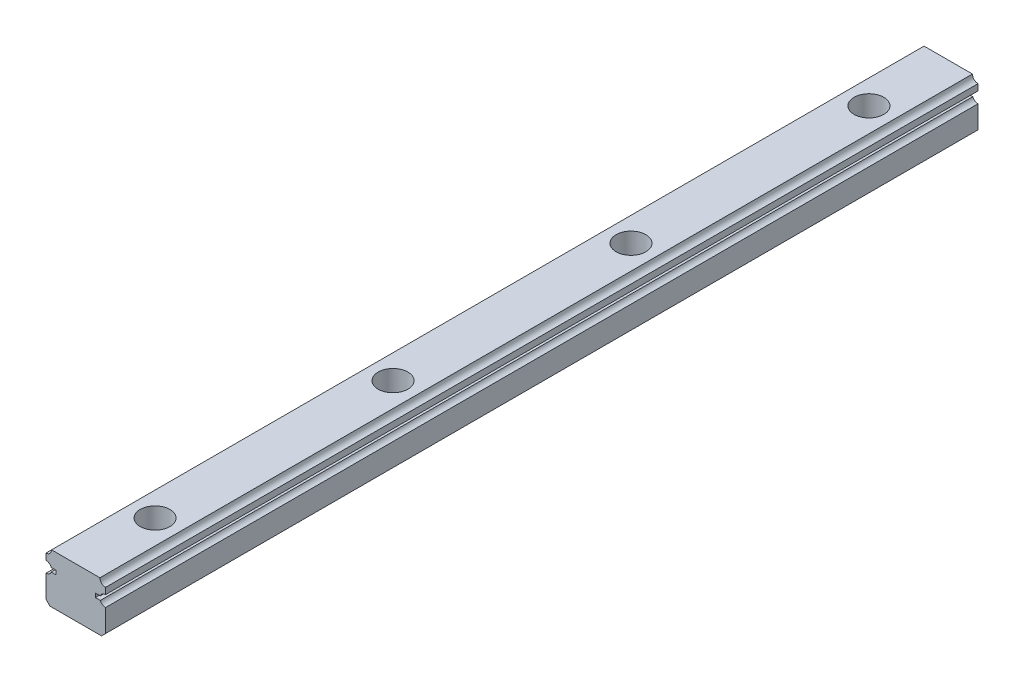
ISO-10303-21;
HEADER;
FILE_DESCRIPTION(('STEP AP214'),'2;1');
FILE_NAME('part.step','',(''),(''),'','','');
FILE_SCHEMA(('AUTOMOTIVE_DESIGN { 1 0 10303 214 1 1 1 1 }'));
ENDSEC;
DATA;
#1=APPLICATION_CONTEXT('core data for automotive mechanical design processes');
#2=APPLICATION_PROTOCOL_DEFINITION('international standard','automotive_design',2000,#1);
#3=PRODUCT_CONTEXT('',#1,'mechanical');
#4=PRODUCT('Part','Part','',(#3));
#5=PRODUCT_RELATED_PRODUCT_CATEGORY('part','',(#4));
#6=PRODUCT_DEFINITION_FORMATION('','',#4);
#7=PRODUCT_DEFINITION_CONTEXT('part definition',#1,'design');
#8=PRODUCT_DEFINITION('design','',#6,#7);
#9=PRODUCT_DEFINITION_SHAPE('','',#8);
#10=(LENGTH_UNIT() NAMED_UNIT(*) SI_UNIT(.MILLI.,.METRE.));
#11=(NAMED_UNIT(*) PLANE_ANGLE_UNIT() SI_UNIT($,.RADIAN.));
#12=(NAMED_UNIT(*) SI_UNIT($,.STERADIAN.) SOLID_ANGLE_UNIT());
#13=UNCERTAINTY_MEASURE_WITH_UNIT(LENGTH_MEASURE(1.E-05),#10,'distance_accuracy_value','');
#14=(GEOMETRIC_REPRESENTATION_CONTEXT(3) GLOBAL_UNCERTAINTY_ASSIGNED_CONTEXT((#13)) GLOBAL_UNIT_ASSIGNED_CONTEXT((#10,
#11,#12)) REPRESENTATION_CONTEXT('',''));
#15=CARTESIAN_POINT('',(0.,0.,0.));
#16=DIRECTION('',(0.,0.,1.));
#17=DIRECTION('',(1.,0.,0.));
#18=AXIS2_PLACEMENT_3D('',#15,#16,#17);
#19=CARTESIAN_POINT('',(-6.09998900000225,12.4999900000003,110.));
#20=DIRECTION('',(0.,-1.,0.));
#21=DIRECTION('',(1.,0.,0.));
#22=AXIS2_PLACEMENT_3D('',#19,#20,#21);
#23=PLANE('',#22);
#24=CARTESIAN_POINT('',(0.,12.4999900000003,-30.));
#25=DIRECTION('',(0.,1.,0.));
#26=DIRECTION('',(0.,0.,1.));
#27=AXIS2_PLACEMENT_3D('',#24,#25,#26);
#28=CIRCLE('',#27,3.75);
#29=CARTESIAN_POINT('',(0.,12.4999900000003,-26.25));
#30=VERTEX_POINT('',#29);
#31=EDGE_CURVE('E703',#30,#30,#28,.T.);
#32=ORIENTED_EDGE('',*,*,#31,.F.);
#33=EDGE_LOOP('',(#32));
#34=FACE_BOUND('',#33,.T.);
#35=DIRECTION('',(-1.,0.,0.));
#36=VECTOR('',#35,1.);
#37=CARTESIAN_POINT('',(-6.09998900000225,12.4999900000003,-110.));
#38=LINE('',#37,#36);
#39=CARTESIAN_POINT('',(6.09998900000225,12.4999900000003,-110.));
#40=VERTEX_POINT('',#39);
#41=CARTESIAN_POINT('',(-6.09998900000225,12.4999900000003,-110.));
#42=VERTEX_POINT('',#41);
#43=EDGE_CURVE('E211',#40,#42,#38,.T.);
#44=ORIENTED_EDGE('',*,*,#43,.T.);
#45=DIRECTION('',(0.,0.,-1.));
#46=VECTOR('',#45,1.);
#47=CARTESIAN_POINT('',(-6.09998900000225,12.4999900000003,110.));
#48=LINE('',#47,#46);
#49=CARTESIAN_POINT('',(-6.09998900000225,12.4999900000003,110.));
#50=VERTEX_POINT('',#49);
#51=EDGE_CURVE('E282',#50,#42,#48,.T.);
#52=ORIENTED_EDGE('',*,*,#51,.F.);
#53=DIRECTION('',(-1.,0.,0.));
#54=VECTOR('',#53,1.);
#55=CARTESIAN_POINT('',(-6.09998900000225,12.4999900000003,110.));
#56=LINE('',#55,#54);
#57=CARTESIAN_POINT('',(6.09998900000225,12.4999900000003,110.));
#58=VERTEX_POINT('',#57);
#59=EDGE_CURVE('E311',#58,#50,#56,.T.);
#60=ORIENTED_EDGE('',*,*,#59,.F.);
#61=DIRECTION('',(0.,0.,-1.));
#62=VECTOR('',#61,1.);
#63=CARTESIAN_POINT('',(6.09998900000225,12.4999900000003,110.));
#64=LINE('',#63,#62);
#65=EDGE_CURVE('E285',#58,#40,#64,.T.);
#66=ORIENTED_EDGE('',*,*,#65,.T.);
#67=EDGE_LOOP('',(#44,#52,#60,#66));
#68=FACE_BOUND('',#67,.T.);
#69=CARTESIAN_POINT('',(0.,12.4999900000003,90.));
#70=DIRECTION('',(0.,-1.,0.));
#71=DIRECTION('',(0.,0.,-1.));
#72=AXIS2_PLACEMENT_3D('',#69,#70,#71);
#73=CIRCLE('',#72,3.75);
#74=CARTESIAN_POINT('',(0.,12.4999900000003,86.25));
#75=VERTEX_POINT('',#74);
#76=EDGE_CURVE('E207',#75,#75,#73,.T.);
#77=ORIENTED_EDGE('',*,*,#76,.T.);
#78=EDGE_LOOP('',(#77));
#79=FACE_BOUND('',#78,.T.);
#80=CARTESIAN_POINT('',(0.,12.4999900000003,-90.));
#81=DIRECTION('',(0.,1.,0.));
#82=DIRECTION('',(0.,0.,1.));
#83=AXIS2_PLACEMENT_3D('',#80,#81,#82);
#84=CIRCLE('',#83,3.75);
#85=CARTESIAN_POINT('',(0.,12.4999900000003,-86.25));
#86=VERTEX_POINT('',#85);
#87=EDGE_CURVE('E722',#86,#86,#84,.T.);
#88=ORIENTED_EDGE('',*,*,#87,.F.);
#89=EDGE_LOOP('',(#88));
#90=FACE_BOUND('',#89,.T.);
#91=CARTESIAN_POINT('',(0.,12.4999900000003,30.));
#92=DIRECTION('',(0.,1.,0.));
#93=DIRECTION('',(0.,0.,1.));
#94=AXIS2_PLACEMENT_3D('',#91,#92,#93);
#95=CIRCLE('',#94,3.75);
#96=CARTESIAN_POINT('',(0.,12.4999900000003,33.75));
#97=VERTEX_POINT('',#96);
#98=EDGE_CURVE('E753',#97,#97,#95,.T.);
#99=ORIENTED_EDGE('',*,*,#98,.F.);
#100=EDGE_LOOP('',(#99));
#101=FACE_BOUND('',#100,.T.);
#102=ADVANCED_FACE('F34',(#34,#68,#79,#90,#101),#23,.F.);
#103=CARTESIAN_POINT('',(6.49996585786402,0.,110.));
#104=DIRECTION('',(0.,1.,0.));
#105=DIRECTION('',(0.,0.,1.));
#106=AXIS2_PLACEMENT_3D('',#103,#104,#105);
#107=PLANE('',#106);
#108=CARTESIAN_POINT('',(0.,0.,-30.));
#109=DIRECTION('',(0.,1.,0.));
#110=DIRECTION('',(0.,0.,1.));
#111=AXIS2_PLACEMENT_3D('',#108,#109,#110);
#112=CIRCLE('',#111,2.25);
#113=CARTESIAN_POINT('',(0.,0.,-27.75));
#114=VERTEX_POINT('',#113);
#115=EDGE_CURVE('E719',#114,#114,#112,.T.);
#116=ORIENTED_EDGE('',*,*,#115,.T.);
#117=EDGE_LOOP('',(#116));
#118=FACE_BOUND('',#117,.T.);
#119=DIRECTION('',(1.,0.,0.));
#120=VECTOR('',#119,1.);
#121=CARTESIAN_POINT('',(6.49996585786402,0.,-110.));
#122=LINE('',#121,#120);
#123=CARTESIAN_POINT('',(-6.49996585786388,0.,-110.));
#124=VERTEX_POINT('',#123);
#125=CARTESIAN_POINT('',(6.49996585786402,0.,-110.));
#126=VERTEX_POINT('',#125);
#127=EDGE_CURVE('E231',#124,#126,#122,.T.);
#128=ORIENTED_EDGE('',*,*,#127,.T.);
#129=DIRECTION('',(0.,0.,-1.));
#130=VECTOR('',#129,1.);
#131=CARTESIAN_POINT('',(6.49996585786402,0.,110.));
#132=LINE('',#131,#130);
#133=CARTESIAN_POINT('',(6.49996585786402,0.,110.));
#134=VERTEX_POINT('',#133);
#135=EDGE_CURVE('E252',#134,#126,#132,.T.);
#136=ORIENTED_EDGE('',*,*,#135,.F.);
#137=DIRECTION('',(1.,0.,0.));
#138=VECTOR('',#137,1.);
#139=CARTESIAN_POINT('',(6.49996585786402,0.,110.));
#140=LINE('',#139,#138);
#141=CARTESIAN_POINT('',(-6.49996585786388,0.,110.));
#142=VERTEX_POINT('',#141);
#143=EDGE_CURVE('E331',#142,#134,#140,.T.);
#144=ORIENTED_EDGE('',*,*,#143,.F.);
#145=DIRECTION('',(0.,0.,-1.));
#146=VECTOR('',#145,1.);
#147=CARTESIAN_POINT('',(-6.49996585786388,0.,110.));
#148=LINE('',#147,#146);
#149=EDGE_CURVE('E255',#142,#124,#148,.T.);
#150=ORIENTED_EDGE('',*,*,#149,.T.);
#151=EDGE_LOOP('',(#128,#136,#144,#150));
#152=FACE_BOUND('',#151,.T.);
#153=CARTESIAN_POINT('',(0.,0.,90.));
#154=DIRECTION('',(0.,-1.,0.));
#155=DIRECTION('',(0.,0.,-1.));
#156=AXIS2_PLACEMENT_3D('',#153,#154,#155);
#157=CIRCLE('',#156,2.25);
#158=CARTESIAN_POINT('',(0.,0.,87.75));
#159=VERTEX_POINT('',#158);
#160=EDGE_CURVE('E694',#159,#159,#157,.T.);
#161=ORIENTED_EDGE('',*,*,#160,.F.);
#162=EDGE_LOOP('',(#161));
#163=FACE_BOUND('',#162,.T.);
#164=CARTESIAN_POINT('',(0.,0.,-90.));
#165=DIRECTION('',(0.,1.,0.));
#166=DIRECTION('',(0.,0.,1.));
#167=AXIS2_PLACEMENT_3D('',#164,#165,#166);
#168=CIRCLE('',#167,2.25);
#169=CARTESIAN_POINT('',(0.,0.,-87.75));
#170=VERTEX_POINT('',#169);
#171=EDGE_CURVE('E698',#170,#170,#168,.T.);
#172=ORIENTED_EDGE('',*,*,#171,.T.);
#173=EDGE_LOOP('',(#172));
#174=FACE_BOUND('',#173,.T.);
#175=CARTESIAN_POINT('',(0.,0.,30.));
#176=DIRECTION('',(0.,1.,0.));
#177=DIRECTION('',(0.,0.,1.));
#178=AXIS2_PLACEMENT_3D('',#175,#176,#177);
#179=CIRCLE('',#178,2.25);
#180=CARTESIAN_POINT('',(0.,0.,32.25));
#181=VERTEX_POINT('',#180);
#182=EDGE_CURVE('E701',#181,#181,#179,.T.);
#183=ORIENTED_EDGE('',*,*,#182,.T.);
#184=EDGE_LOOP('',(#183));
#185=FACE_BOUND('',#184,.T.);
#186=ADVANCED_FACE('F360',(#118,#152,#163,#174,#185),#107,.F.);
#187=CARTESIAN_POINT('',(7.49999000000021,8.09999999996976,110.));
#188=DIRECTION('',(0.,0.,-1.));
#189=DIRECTION('',(-1.,0.,0.));
#190=AXIS2_PLACEMENT_3D('',#187,#188,#189);
#191=CYLINDRICAL_SURFACE('',#190,1.4);
#192=CARTESIAN_POINT('',(7.49999000000021,8.09999999996976,-110.));
#193=DIRECTION('',(0.,0.,-1.));
#194=DIRECTION('',(-1.,0.,0.));
#195=AXIS2_PLACEMENT_3D('',#192,#193,#194);
#196=CIRCLE('',#195,1.4);
#197=CARTESIAN_POINT('',(6.19232643481465,8.60001599999995,-110.));
#198=VERTEX_POINT('',#197);
#199=CARTESIAN_POINT('',(7.49998999999975,9.49999999996977,-110.));
#200=VERTEX_POINT('',#199);
#201=EDGE_CURVE('E203',#198,#200,#196,.T.);
#202=ORIENTED_EDGE('',*,*,#201,.T.);
#203=DIRECTION('',(0.,0.,-1.));
#204=VECTOR('',#203,1.);
#205=CARTESIAN_POINT('',(7.49998999999975,9.49999999996977,110.));
#206=LINE('',#205,#204);
#207=CARTESIAN_POINT('',(7.49998999999975,9.49999999996977,110.));
#208=VERTEX_POINT('',#207);
#209=EDGE_CURVE('E11',#208,#200,#206,.T.);
#210=ORIENTED_EDGE('',*,*,#209,.F.);
#211=CARTESIAN_POINT('',(7.49999000000021,8.09999999996976,110.));
#212=DIRECTION('',(0.,0.,-1.));
#213=DIRECTION('',(-1.,0.,0.));
#214=AXIS2_PLACEMENT_3D('',#211,#212,#213);
#215=CIRCLE('',#214,1.4);
#216=CARTESIAN_POINT('',(6.19232643481465,8.60001599999995,110.));
#217=VERTEX_POINT('',#216);
#218=EDGE_CURVE('E242',#217,#208,#215,.T.);
#219=ORIENTED_EDGE('',*,*,#218,.F.);
#220=DIRECTION('',(0.,0.,-1.));
#221=VECTOR('',#220,1.);
#222=CARTESIAN_POINT('',(6.19232643481465,8.60001599999995,110.));
#223=LINE('',#222,#221);
#224=EDGE_CURVE('E199',#217,#198,#223,.T.);
#225=ORIENTED_EDGE('',*,*,#224,.T.);
#226=EDGE_LOOP('',(#202,#210,#219,#225));
#227=FACE_BOUND('',#226,.T.);
#228=ADVANCED_FACE('F36',(#227),#191,.F.);
#229=CARTESIAN_POINT('',(7.49998999999975,11.0999740000294,110.));
#230=DIRECTION('',(-1.,0.,0.));
#231=DIRECTION('',(0.,-1.,0.));
#232=AXIS2_PLACEMENT_3D('',#229,#230,#231);
#233=PLANE('',#232);
#234=DIRECTION('',(0.,1.,0.));
#235=VECTOR('',#234,1.);
#236=CARTESIAN_POINT('',(7.49998999999975,11.0999740000294,-110.));
#237=LINE('',#236,#235);
#238=CARTESIAN_POINT('',(7.49998999999975,11.0999740000294,-110.));
#239=VERTEX_POINT('',#238);
#240=EDGE_CURVE('E206',#200,#239,#237,.T.);
#241=ORIENTED_EDGE('',*,*,#240,.T.);
#242=DIRECTION('',(0.,0.,-1.));
#243=VECTOR('',#242,1.);
#244=CARTESIAN_POINT('',(7.49998999999975,11.0999740000294,110.));
#245=LINE('',#244,#243);
#246=CARTESIAN_POINT('',(7.49998999999975,11.0999740000294,110.));
#247=VERTEX_POINT('',#246);
#248=EDGE_CURVE('E43',#247,#239,#245,.T.);
#249=ORIENTED_EDGE('',*,*,#248,.F.);
#250=DIRECTION('',(0.,1.,0.));
#251=VECTOR('',#250,1.);
#252=CARTESIAN_POINT('',(7.49998999999975,11.0999740000294,110.));
#253=LINE('',#252,#251);
#254=EDGE_CURVE('E130',#208,#247,#253,.T.);
#255=ORIENTED_EDGE('',*,*,#254,.F.);
#256=ORIENTED_EDGE('',*,*,#209,.T.);
#257=EDGE_LOOP('',(#241,#249,#255,#256));
#258=FACE_BOUND('',#257,.T.);
#259=ADVANCED_FACE('F373',(#258),#233,.F.);
#260=CARTESIAN_POINT('',(7.49999999999328,12.4999849999937,110.));
#261=DIRECTION('',(0.,0.,-1.));
#262=DIRECTION('',(-1.,0.,0.));
#263=AXIS2_PLACEMENT_3D('',#260,#261,#262);
#264=CYLINDRICAL_SURFACE('',#263,1.40001099999996);
#265=CARTESIAN_POINT('',(7.49999999999328,12.4999849999937,-110.));
#266=DIRECTION('',(0.,0.,-1.));
#267=DIRECTION('',(-1.,0.,0.));
#268=AXIS2_PLACEMENT_3D('',#265,#266,#267);
#269=CIRCLE('',#268,1.40001099999996);
#270=EDGE_CURVE('E209',#239,#40,#269,.T.);
#271=ORIENTED_EDGE('',*,*,#270,.T.);
#272=ORIENTED_EDGE('',*,*,#65,.F.);
#273=CARTESIAN_POINT('',(7.49999999999328,12.4999849999937,110.));
#274=DIRECTION('',(0.,0.,-1.));
#275=DIRECTION('',(-1.,0.,0.));
#276=AXIS2_PLACEMENT_3D('',#273,#274,#275);
#277=CIRCLE('',#276,1.40001099999996);
#278=EDGE_CURVE('E293',#247,#58,#277,.T.);
#279=ORIENTED_EDGE('',*,*,#278,.F.);
#280=ORIENTED_EDGE('',*,*,#248,.T.);
#281=EDGE_LOOP('',(#271,#272,#279,#280));
#282=FACE_BOUND('',#281,.T.);
#283=ADVANCED_FACE('F291',(#282),#264,.F.);
#284=CARTESIAN_POINT('',(-7.49999999999333,12.4999849999938,110.));
#285=DIRECTION('',(0.,0.,-1.));
#286=DIRECTION('',(-1.,0.,0.));
#287=AXIS2_PLACEMENT_3D('',#284,#285,#286);
#288=CYLINDRICAL_SURFACE('',#287,1.40001100000001);
#289=CARTESIAN_POINT('',(-7.49999999999333,12.4999849999938,-110.));
#290=DIRECTION('',(0.,0.,-1.));
#291=DIRECTION('',(-1.,0.,0.));
#292=AXIS2_PLACEMENT_3D('',#289,#290,#291);
#293=CIRCLE('',#292,1.40001100000001);
#294=CARTESIAN_POINT('',(-7.49998999999979,11.0999740000295,-110.));
#295=VERTEX_POINT('',#294);
#296=EDGE_CURVE('E213',#42,#295,#293,.T.);
#297=ORIENTED_EDGE('',*,*,#296,.T.);
#298=DIRECTION('',(0.,0.,-1.));
#299=VECTOR('',#298,1.);
#300=CARTESIAN_POINT('',(-7.49998999999979,11.0999740000295,110.));
#301=LINE('',#300,#299);
#302=CARTESIAN_POINT('',(-7.49998999999979,11.0999740000295,110.));
#303=VERTEX_POINT('',#302);
#304=EDGE_CURVE('E279',#303,#295,#301,.T.);
#305=ORIENTED_EDGE('',*,*,#304,.F.);
#306=CARTESIAN_POINT('',(-7.49999999999333,12.4999849999938,110.));
#307=DIRECTION('',(0.,0.,-1.));
#308=DIRECTION('',(-1.,0.,0.));
#309=AXIS2_PLACEMENT_3D('',#306,#307,#308);
#310=CIRCLE('',#309,1.40001100000001);
#311=EDGE_CURVE('E308',#50,#303,#310,.T.);
#312=ORIENTED_EDGE('',*,*,#311,.F.);
#313=ORIENTED_EDGE('',*,*,#51,.T.);
#314=EDGE_LOOP('',(#297,#305,#312,#313));
#315=FACE_BOUND('',#314,.T.);
#316=ADVANCED_FACE('F306',(#315),#288,.F.);
#317=CARTESIAN_POINT('',(-7.49998999999981,9.49999999994918,110.));
#318=DIRECTION('',(1.,0.,0.));
#319=DIRECTION('',(0.,1.,0.));
#320=AXIS2_PLACEMENT_3D('',#317,#318,#319);
#321=PLANE('',#320);
#322=DIRECTION('',(0.,-1.,0.));
#323=VECTOR('',#322,1.);
#324=CARTESIAN_POINT('',(-7.49998999999981,9.49999999994918,-110.));
#325=LINE('',#324,#323);
#326=CARTESIAN_POINT('',(-7.49998999999981,9.49999999994918,-110.));
#327=VERTEX_POINT('',#326);
#328=EDGE_CURVE('E215',#295,#327,#325,.T.);
#329=ORIENTED_EDGE('',*,*,#328,.T.);
#330=DIRECTION('',(0.,0.,-1.));
#331=VECTOR('',#330,1.);
#332=CARTESIAN_POINT('',(-7.49998999999981,9.49999999994918,110.));
#333=LINE('',#332,#331);
#334=CARTESIAN_POINT('',(-7.49998999999981,9.49999999994918,110.));
#335=VERTEX_POINT('',#334);
#336=EDGE_CURVE('E276',#335,#327,#333,.T.);
#337=ORIENTED_EDGE('',*,*,#336,.F.);
#338=DIRECTION('',(0.,-1.,0.));
#339=VECTOR('',#338,1.);
#340=CARTESIAN_POINT('',(-7.49998999999981,9.49999999994918,110.));
#341=LINE('',#340,#339);
#342=EDGE_CURVE('E310',#303,#335,#341,.T.);
#343=ORIENTED_EDGE('',*,*,#342,.F.);
#344=ORIENTED_EDGE('',*,*,#304,.T.);
#345=EDGE_LOOP('',(#329,#337,#343,#344));
#346=FACE_BOUND('',#345,.T.);
#347=ADVANCED_FACE('F631',(#346),#321,.F.);
#348=CARTESIAN_POINT('',(-7.49998999999982,8.09999999994918,110.));
#349=DIRECTION('',(0.,0.,-1.));
#350=DIRECTION('',(-1.,0.,0.));
#351=AXIS2_PLACEMENT_3D('',#348,#349,#350);
#352=CYLINDRICAL_SURFACE('',#351,1.4);
#353=CARTESIAN_POINT('',(-7.49998999999982,8.09999999994918,-110.));
#354=DIRECTION('',(0.,0.,-1.));
#355=DIRECTION('',(-1.,0.,0.));
#356=AXIS2_PLACEMENT_3D('',#353,#354,#355);
#357=CIRCLE('',#356,1.4);
#358=CARTESIAN_POINT('',(-6.19232643481046,8.60001599996944,-110.));
#359=VERTEX_POINT('',#358);
#360=EDGE_CURVE('E217',#327,#359,#357,.T.);
#361=ORIENTED_EDGE('',*,*,#360,.T.);
#362=DIRECTION('',(0.,0.,-1.));
#363=VECTOR('',#362,1.);
#364=CARTESIAN_POINT('',(-6.19232643481046,8.60001599996944,110.));
#365=LINE('',#364,#363);
#366=CARTESIAN_POINT('',(-6.19232643481046,8.60001599996944,110.));
#367=VERTEX_POINT('',#366);
#368=EDGE_CURVE('E273',#367,#359,#365,.T.);
#369=ORIENTED_EDGE('',*,*,#368,.F.);
#370=CARTESIAN_POINT('',(-7.49998999999982,8.09999999994918,110.));
#371=DIRECTION('',(0.,0.,-1.));
#372=DIRECTION('',(-1.,0.,0.));
#373=AXIS2_PLACEMENT_3D('',#370,#371,#372);
#374=CIRCLE('',#373,1.4);
#375=EDGE_CURVE('E313',#335,#367,#374,.T.);
#376=ORIENTED_EDGE('',*,*,#375,.F.);
#377=ORIENTED_EDGE('',*,*,#336,.T.);
#378=EDGE_LOOP('',(#361,#369,#376,#377));
#379=FACE_BOUND('',#378,.T.);
#380=ADVANCED_FACE('F621',(#379),#352,.F.);
#381=CARTESIAN_POINT('',(-4.94997199999982,8.60000600000019,110.));
#382=DIRECTION('',(8.04920799129945E-06,0.999999999967605,0.));
#383=DIRECTION('',(-0.999999999967605,8.04920799129945E-06,0.));
#384=AXIS2_PLACEMENT_3D('',#381,#382,#383);
#385=PLANE('',#384);
#386=DIRECTION('',(0.999999999967605,-8.04920799129945E-06,0.));
#387=VECTOR('',#386,1.);
#388=CARTESIAN_POINT('',(-4.94997199999982,8.60000600000019,-110.));
#389=LINE('',#388,#387);
#390=CARTESIAN_POINT('',(-4.94997199999982,8.60000600000019,-110.));
#391=VERTEX_POINT('',#390);
#392=EDGE_CURVE('E219',#359,#391,#389,.T.);
#393=ORIENTED_EDGE('',*,*,#392,.T.);
#394=DIRECTION('',(0.,0.,-1.));
#395=VECTOR('',#394,1.);
#396=CARTESIAN_POINT('',(-4.94997199999982,8.60000600000019,110.));
#397=LINE('',#396,#395);
#398=CARTESIAN_POINT('',(-4.94997199999982,8.60000600000019,110.));
#399=VERTEX_POINT('',#398);
#400=EDGE_CURVE('E270',#399,#391,#397,.T.);
#401=ORIENTED_EDGE('',*,*,#400,.F.);
#402=DIRECTION('',(0.999999999967605,-8.04920799129945E-06,0.));
#403=VECTOR('',#402,1.);
#404=CARTESIAN_POINT('',(-4.94997199999982,8.60000600000019,110.));
#405=LINE('',#404,#403);
#406=EDGE_CURVE('E319',#367,#399,#405,.T.);
#407=ORIENTED_EDGE('',*,*,#406,.F.);
#408=ORIENTED_EDGE('',*,*,#368,.T.);
#409=EDGE_LOOP('',(#393,#401,#407,#408));
#410=FACE_BOUND('',#409,.T.);
#411=ADVANCED_FACE('F611',(#410),#385,.F.);
#412=CARTESIAN_POINT('',(-4.9499819999998,7.59999600000017,110.));
#413=DIRECTION('',(0.999999999950001,-9.99989999003211E-06,0.));
#414=DIRECTION('',(9.99989999003211E-06,0.999999999950001,0.));
#415=AXIS2_PLACEMENT_3D('',#412,#413,#414);
#416=PLANE('',#415);
#417=DIRECTION('',(-9.99989999003211E-06,-0.999999999950001,0.));
#418=VECTOR('',#417,1.);
#419=CARTESIAN_POINT('',(-4.9499819999998,7.59999600000017,-110.));
#420=LINE('',#419,#418);
#421=CARTESIAN_POINT('',(-4.9499819999998,7.59999600000017,-110.));
#422=VERTEX_POINT('',#421);
#423=EDGE_CURVE('E221',#391,#422,#420,.T.);
#424=ORIENTED_EDGE('',*,*,#423,.T.);
#425=DIRECTION('',(0.,0.,-1.));
#426=VECTOR('',#425,1.);
#427=CARTESIAN_POINT('',(-4.9499819999998,7.59999600000017,110.));
#428=LINE('',#427,#426);
#429=CARTESIAN_POINT('',(-4.9499819999998,7.59999600000017,110.));
#430=VERTEX_POINT('',#429);
#431=EDGE_CURVE('E267',#430,#422,#428,.T.);
#432=ORIENTED_EDGE('',*,*,#431,.F.);
#433=DIRECTION('',(-9.99989999003211E-06,-0.999999999950001,0.));
#434=VECTOR('',#433,1.);
#435=CARTESIAN_POINT('',(-4.9499819999998,7.59999600000017,110.));
#436=LINE('',#435,#434);
#437=EDGE_CURVE('E321',#399,#430,#436,.T.);
#438=ORIENTED_EDGE('',*,*,#437,.F.);
#439=ORIENTED_EDGE('',*,*,#400,.T.);
#440=EDGE_LOOP('',(#424,#432,#438,#439));
#441=FACE_BOUND('',#440,.T.);
#442=ADVANCED_FACE('F601',(#441),#416,.F.);
#443=CARTESIAN_POINT('',(-6.19232184636335,7.59999600000018,110.));
#444=DIRECTION('',(0.,-1.,0.));
#445=DIRECTION('',(1.,0.,0.));
#446=AXIS2_PLACEMENT_3D('',#443,#444,#445);
#447=PLANE('',#446);
#448=DIRECTION('',(-1.,0.,0.));
#449=VECTOR('',#448,1.);
#450=CARTESIAN_POINT('',(-6.19232184636335,7.59999600000018,-110.));
#451=LINE('',#450,#449);
#452=CARTESIAN_POINT('',(-6.19232184636335,7.59999600000018,-110.));
#453=VERTEX_POINT('',#452);
#454=EDGE_CURVE('E223',#422,#453,#451,.T.);
#455=ORIENTED_EDGE('',*,*,#454,.T.);
#456=DIRECTION('',(0.,0.,-1.));
#457=VECTOR('',#456,1.);
#458=CARTESIAN_POINT('',(-6.19232184636335,7.59999600000018,110.));
#459=LINE('',#458,#457);
#460=CARTESIAN_POINT('',(-6.19232184636335,7.59999600000018,110.));
#461=VERTEX_POINT('',#460);
#462=EDGE_CURVE('E264',#461,#453,#459,.T.);
#463=ORIENTED_EDGE('',*,*,#462,.F.);
#464=DIRECTION('',(-1.,0.,0.));
#465=VECTOR('',#464,1.);
#466=CARTESIAN_POINT('',(-6.19232184636335,7.59999600000018,110.));
#467=LINE('',#466,#465);
#468=EDGE_CURVE('E323',#430,#461,#467,.T.);
#469=ORIENTED_EDGE('',*,*,#468,.F.);
#470=ORIENTED_EDGE('',*,*,#431,.T.);
#471=EDGE_LOOP('',(#455,#463,#469,#470));
#472=FACE_BOUND('',#471,.T.);
#473=ADVANCED_FACE('F591',(#472),#447,.F.);
#474=CARTESIAN_POINT('',(-7.49998999999982,8.09999999994918,110.));
#475=DIRECTION('',(0.,0.,-1.));
#476=DIRECTION('',(-1.,0.,0.));
#477=AXIS2_PLACEMENT_3D('',#474,#475,#476);
#478=CYLINDRICAL_SURFACE('',#477,1.40000000000001);
#479=CARTESIAN_POINT('',(-7.49998999999982,8.09999999994918,-110.));
#480=DIRECTION('',(0.,0.,-1.));
#481=DIRECTION('',(-1.,0.,0.));
#482=AXIS2_PLACEMENT_3D('',#479,#480,#481);
#483=CIRCLE('',#482,1.40000000000001);
#484=CARTESIAN_POINT('',(-7.49998999999966,6.69999999994918,-110.));
#485=VERTEX_POINT('',#484);
#486=EDGE_CURVE('E225',#453,#485,#483,.T.);
#487=ORIENTED_EDGE('',*,*,#486,.T.);
#488=DIRECTION('',(0.,0.,-1.));
#489=VECTOR('',#488,1.);
#490=CARTESIAN_POINT('',(-7.49998999999966,6.69999999994918,110.));
#491=LINE('',#490,#489);
#492=CARTESIAN_POINT('',(-7.49998999999966,6.69999999994918,110.));
#493=VERTEX_POINT('',#492);
#494=EDGE_CURVE('E261',#493,#485,#491,.T.);
#495=ORIENTED_EDGE('',*,*,#494,.F.);
#496=CARTESIAN_POINT('',(-7.49998999999982,8.09999999994918,110.));
#497=DIRECTION('',(0.,0.,-1.));
#498=DIRECTION('',(-1.,0.,0.));
#499=AXIS2_PLACEMENT_3D('',#496,#497,#498);
#500=CIRCLE('',#499,1.40000000000001);
#501=EDGE_CURVE('E325',#461,#493,#500,.T.);
#502=ORIENTED_EDGE('',*,*,#501,.F.);
#503=ORIENTED_EDGE('',*,*,#462,.T.);
#504=EDGE_LOOP('',(#487,#495,#502,#503));
#505=FACE_BOUND('',#504,.T.);
#506=ADVANCED_FACE('F581',(#505),#478,.F.);
#507=CARTESIAN_POINT('',(-7.49998999999966,1.00002414213572,110.));
#508=DIRECTION('',(1.,0.,0.));
#509=DIRECTION('',(0.,1.,0.));
#510=AXIS2_PLACEMENT_3D('',#507,#508,#509);
#511=PLANE('',#510);
#512=DIRECTION('',(0.,-1.,0.));
#513=VECTOR('',#512,1.);
#514=CARTESIAN_POINT('',(-7.49998999999966,1.00002414213572,-110.));
#515=LINE('',#514,#513);
#516=CARTESIAN_POINT('',(-7.49998999999966,1.00002414213572,-110.));
#517=VERTEX_POINT('',#516);
#518=EDGE_CURVE('E227',#485,#517,#515,.T.);
#519=ORIENTED_EDGE('',*,*,#518,.T.);
#520=DIRECTION('',(0.,0.,-1.));
#521=VECTOR('',#520,1.);
#522=CARTESIAN_POINT('',(-7.49998999999966,1.00002414213572,110.));
#523=LINE('',#522,#521);
#524=CARTESIAN_POINT('',(-7.49998999999966,1.00002414213572,110.));
#525=VERTEX_POINT('',#524);
#526=EDGE_CURVE('E258',#525,#517,#523,.T.);
#527=ORIENTED_EDGE('',*,*,#526,.F.);
#528=DIRECTION('',(0.,-1.,0.));
#529=VECTOR('',#528,1.);
#530=CARTESIAN_POINT('',(-7.49998999999966,1.00002414213572,110.));
#531=LINE('',#530,#529);
#532=EDGE_CURVE('E327',#493,#525,#531,.T.);
#533=ORIENTED_EDGE('',*,*,#532,.F.);
#534=ORIENTED_EDGE('',*,*,#494,.T.);
#535=EDGE_LOOP('',(#519,#527,#533,#534));
#536=FACE_BOUND('',#535,.T.);
#537=ADVANCED_FACE('F571',(#536),#511,.F.);
#538=CARTESIAN_POINT('',(-6.49996585786388,0.,110.));
#539=DIRECTION('',(0.707106781186548,0.707106781186548,0.));
#540=DIRECTION('',(-0.707106781186548,0.707106781186548,0.));
#541=AXIS2_PLACEMENT_3D('',#538,#539,#540);
#542=PLANE('',#541);
#543=DIRECTION('',(0.707106781186548,-0.707106781186548,0.));
#544=VECTOR('',#543,1.);
#545=CARTESIAN_POINT('',(-6.49996585786388,0.,-110.));
#546=LINE('',#545,#544);
#547=EDGE_CURVE('E229',#517,#124,#546,.T.);
#548=ORIENTED_EDGE('',*,*,#547,.T.);
#549=ORIENTED_EDGE('',*,*,#149,.F.);
#550=DIRECTION('',(0.707106781186548,-0.707106781186548,0.));
#551=VECTOR('',#550,1.);
#552=CARTESIAN_POINT('',(-6.49996585786388,0.,110.));
#553=LINE('',#552,#551);
#554=EDGE_CURVE('E329',#525,#142,#553,.T.);
#555=ORIENTED_EDGE('',*,*,#554,.F.);
#556=ORIENTED_EDGE('',*,*,#526,.T.);
#557=EDGE_LOOP('',(#548,#549,#555,#556));
#558=FACE_BOUND('',#557,.T.);
#559=ADVANCED_FACE('F561',(#558),#542,.F.);
#560=CARTESIAN_POINT('',(7.49999,1.00002414213591,110.));
#561=DIRECTION('',(-0.707106781186548,0.707106781186547,0.));
#562=DIRECTION('',(-0.707106781186547,-0.707106781186548,0.));
#563=AXIS2_PLACEMENT_3D('',#560,#561,#562);
#564=PLANE('',#563);
#565=DIRECTION('',(0.707106781186547,0.707106781186548,0.));
#566=VECTOR('',#565,1.);
#567=CARTESIAN_POINT('',(7.49999,1.00002414213591,-110.));
#568=LINE('',#567,#566);
#569=CARTESIAN_POINT('',(7.49999,1.00002414213591,-110.));
#570=VERTEX_POINT('',#569);
#571=EDGE_CURVE('E233',#126,#570,#568,.T.);
#572=ORIENTED_EDGE('',*,*,#571,.T.);
#573=DIRECTION('',(0.,0.,-1.));
#574=VECTOR('',#573,1.);
#575=CARTESIAN_POINT('',(7.49999,1.00002414213591,110.));
#576=LINE('',#575,#574);
#577=CARTESIAN_POINT('',(7.49999,1.00002414213591,110.));
#578=VERTEX_POINT('',#577);
#579=EDGE_CURVE('E249',#578,#570,#576,.T.);
#580=ORIENTED_EDGE('',*,*,#579,.F.);
#581=DIRECTION('',(0.707106781186547,0.707106781186548,0.));
#582=VECTOR('',#581,1.);
#583=CARTESIAN_POINT('',(7.49999,1.00002414213591,110.));
#584=LINE('',#583,#582);
#585=EDGE_CURVE('E333',#134,#578,#584,.T.);
#586=ORIENTED_EDGE('',*,*,#585,.F.);
#587=ORIENTED_EDGE('',*,*,#135,.T.);
#588=EDGE_LOOP('',(#572,#580,#586,#587));
#589=FACE_BOUND('',#588,.T.);
#590=ADVANCED_FACE('F552',(#589),#564,.F.);
#591=CARTESIAN_POINT('',(7.49999,6.69999999996978,110.));
#592=DIRECTION('',(-1.,0.,0.));
#593=DIRECTION('',(0.,0.,1.));
#594=AXIS2_PLACEMENT_3D('',#591,#592,#593);
#595=PLANE('',#594);
#596=DIRECTION('',(0.,1.,0.));
#597=VECTOR('',#596,1.);
#598=CARTESIAN_POINT('',(7.49999,6.69999999996978,-110.));
#599=LINE('',#598,#597);
#600=CARTESIAN_POINT('',(7.49999,6.69999999996978,-110.));
#601=VERTEX_POINT('',#600);
#602=EDGE_CURVE('E235',#570,#601,#599,.T.);
#603=ORIENTED_EDGE('',*,*,#602,.T.);
#604=DIRECTION('',(0.,0.,-1.));
#605=VECTOR('',#604,1.);
#606=CARTESIAN_POINT('',(7.49999,6.69999999996978,110.));
#607=LINE('',#606,#605);
#608=CARTESIAN_POINT('',(7.49999,6.69999999996978,110.));
#609=VERTEX_POINT('',#608);
#610=EDGE_CURVE('E246',#609,#601,#607,.T.);
#611=ORIENTED_EDGE('',*,*,#610,.F.);
#612=DIRECTION('',(0.,1.,0.));
#613=VECTOR('',#612,1.);
#614=CARTESIAN_POINT('',(7.49999,6.69999999996978,110.));
#615=LINE('',#614,#613);
#616=EDGE_CURVE('E335',#578,#609,#615,.T.);
#617=ORIENTED_EDGE('',*,*,#616,.F.);
#618=ORIENTED_EDGE('',*,*,#579,.T.);
#619=EDGE_LOOP('',(#603,#611,#617,#618));
#620=FACE_BOUND('',#619,.T.);
#621=ADVANCED_FACE('F341',(#620),#595,.F.);
#622=CARTESIAN_POINT('',(7.49999000000021,8.09999999996976,110.));
#623=DIRECTION('',(0.,0.,-1.));
#624=DIRECTION('',(-1.,0.,0.));
#625=AXIS2_PLACEMENT_3D('',#622,#623,#624);
#626=CYLINDRICAL_SURFACE('',#625,1.39999999999998);
#627=CARTESIAN_POINT('',(7.49999000000021,8.09999999996976,-110.));
#628=DIRECTION('',(0.,0.,-1.));
#629=DIRECTION('',(-1.,0.,0.));
#630=AXIS2_PLACEMENT_3D('',#627,#628,#629);
#631=CIRCLE('',#630,1.39999999999998);
#632=CARTESIAN_POINT('',(6.19232184638777,7.599995999958,-110.));
#633=VERTEX_POINT('',#632);
#634=EDGE_CURVE('E237',#601,#633,#631,.T.);
#635=ORIENTED_EDGE('',*,*,#634,.T.);
#636=DIRECTION('',(0.,0.,-1.));
#637=VECTOR('',#636,1.);
#638=CARTESIAN_POINT('',(6.19232184638777,7.599995999958,110.));
#639=LINE('',#638,#637);
#640=CARTESIAN_POINT('',(6.19232184638777,7.599995999958,110.));
#641=VERTEX_POINT('',#640);
#642=EDGE_CURVE('E194',#641,#633,#639,.T.);
#643=ORIENTED_EDGE('',*,*,#642,.F.);
#644=CARTESIAN_POINT('',(7.49999000000021,8.09999999996976,110.));
#645=DIRECTION('',(0.,0.,-1.));
#646=DIRECTION('',(-1.,0.,0.));
#647=AXIS2_PLACEMENT_3D('',#644,#645,#646);
#648=CIRCLE('',#647,1.39999999999998);
#649=EDGE_CURVE('E185',#609,#641,#648,.T.);
#650=ORIENTED_EDGE('',*,*,#649,.F.);
#651=ORIENTED_EDGE('',*,*,#610,.T.);
#652=EDGE_LOOP('',(#635,#643,#650,#651));
#653=FACE_BOUND('',#652,.T.);
#654=ADVANCED_FACE('F345',(#653),#626,.F.);
#655=CARTESIAN_POINT('',(4.94997200000024,7.60000599999994,110.));
#656=DIRECTION('',(-8.04929623135913E-06,-0.999999999967605,0.));
#657=DIRECTION('',(0.999999999967605,-8.04929623135913E-06,0.));
#658=AXIS2_PLACEMENT_3D('',#655,#656,#657);
#659=PLANE('',#658);
#660=DIRECTION('',(-0.999999999967604,8.04929623135913E-06,0.));
#661=VECTOR('',#660,1.);
#662=CARTESIAN_POINT('',(4.94997200000024,7.60000599999994,-110.));
#663=LINE('',#662,#661);
#664=CARTESIAN_POINT('',(4.94997200000024,7.60000599999994,-110.));
#665=VERTEX_POINT('',#664);
#666=EDGE_CURVE('E193',#633,#665,#663,.T.);
#667=ORIENTED_EDGE('',*,*,#666,.T.);
#668=DIRECTION('',(0.,0.,-1.));
#669=VECTOR('',#668,1.);
#670=CARTESIAN_POINT('',(4.94997200000024,7.60000599999994,110.));
#671=LINE('',#670,#669);
#672=CARTESIAN_POINT('',(4.94997200000024,7.60000599999994,110.));
#673=VERTEX_POINT('',#672);
#674=EDGE_CURVE('E190',#673,#665,#671,.T.);
#675=ORIENTED_EDGE('',*,*,#674,.F.);
#676=DIRECTION('',(-0.999999999967604,8.04929623135913E-06,0.));
#677=VECTOR('',#676,1.);
#678=CARTESIAN_POINT('',(4.94997200000024,7.60000599999994,110.));
#679=LINE('',#678,#677);
#680=EDGE_CURVE('E179',#641,#673,#679,.T.);
#681=ORIENTED_EDGE('',*,*,#680,.F.);
#682=ORIENTED_EDGE('',*,*,#642,.T.);
#683=EDGE_LOOP('',(#667,#675,#681,#682));
#684=FACE_BOUND('',#683,.T.);
#685=ADVANCED_FACE('F191',(#684),#659,.F.);
#686=CARTESIAN_POINT('',(4.94998200000026,8.60001599999997,110.));
#687=DIRECTION('',(-0.999999999950001,9.9999000160527E-06,0.));
#688=DIRECTION('',(-9.9999000160527E-06,-0.999999999950001,0.));
#689=AXIS2_PLACEMENT_3D('',#686,#687,#688);
#690=PLANE('',#689);
#691=DIRECTION('',(9.9999000160527E-06,0.999999999950001,0.));
#692=VECTOR('',#691,1.);
#693=CARTESIAN_POINT('',(4.94998200000026,8.60001599999997,-110.));
#694=LINE('',#693,#692);
#695=CARTESIAN_POINT('',(4.94998200000026,8.60001599999997,-110.));
#696=VERTEX_POINT('',#695);
#697=EDGE_CURVE('E116',#665,#696,#694,.T.);
#698=ORIENTED_EDGE('',*,*,#697,.T.);
#699=DIRECTION('',(0.,0.,-1.));
#700=VECTOR('',#699,1.);
#701=CARTESIAN_POINT('',(4.94998200000026,8.60001599999997,110.));
#702=LINE('',#701,#700);
#703=CARTESIAN_POINT('',(4.94998200000026,8.60001599999997,110.));
#704=VERTEX_POINT('',#703);
#705=EDGE_CURVE('E195',#704,#696,#702,.T.);
#706=ORIENTED_EDGE('',*,*,#705,.F.);
#707=DIRECTION('',(9.9999000160527E-06,0.999999999950001,0.));
#708=VECTOR('',#707,1.);
#709=CARTESIAN_POINT('',(4.94998200000026,8.60001599999997,110.));
#710=LINE('',#709,#708);
#711=EDGE_CURVE('E183',#673,#704,#710,.T.);
#712=ORIENTED_EDGE('',*,*,#711,.F.);
#713=ORIENTED_EDGE('',*,*,#674,.T.);
#714=EDGE_LOOP('',(#698,#706,#712,#713));
#715=FACE_BOUND('',#714,.T.);
#716=ADVANCED_FACE('F197',(#715),#690,.F.);
#717=CARTESIAN_POINT('',(6.19232643481465,8.60001599999995,110.));
#718=DIRECTION('',(0.,1.,0.));
#719=DIRECTION('',(-1.,0.,0.));
#720=AXIS2_PLACEMENT_3D('',#717,#718,#719);
#721=PLANE('',#720);
#722=DIRECTION('',(1.,0.,0.));
#723=VECTOR('',#722,1.);
#724=CARTESIAN_POINT('',(6.19232643481465,8.60001599999995,-110.));
#725=LINE('',#724,#723);
#726=EDGE_CURVE('E122',#696,#198,#725,.T.);
#727=ORIENTED_EDGE('',*,*,#726,.T.);
#728=ORIENTED_EDGE('',*,*,#224,.F.);
#729=DIRECTION('',(1.,0.,0.));
#730=VECTOR('',#729,1.);
#731=CARTESIAN_POINT('',(6.19232643481465,8.60001599999995,110.));
#732=LINE('',#731,#730);
#733=EDGE_CURVE('E51',#704,#217,#732,.T.);
#734=ORIENTED_EDGE('',*,*,#733,.F.);
#735=ORIENTED_EDGE('',*,*,#705,.T.);
#736=EDGE_LOOP('',(#727,#728,#734,#735));
#737=FACE_BOUND('',#736,.T.);
#738=ADVANCED_FACE('F349',(#737),#721,.F.);
#739=CARTESIAN_POINT('',(7.49999000000021,8.09999999996976,110.));
#740=DIRECTION('',(0.,0.,-1.));
#741=DIRECTION('',(-1.,0.,0.));
#742=AXIS2_PLACEMENT_3D('',#739,#740,#741);
#743=PLANE('',#742);
#744=ORIENTED_EDGE('',*,*,#218,.T.);
#745=ORIENTED_EDGE('',*,*,#254,.T.);
#746=ORIENTED_EDGE('',*,*,#278,.T.);
#747=ORIENTED_EDGE('',*,*,#59,.T.);
#748=ORIENTED_EDGE('',*,*,#311,.T.);
#749=ORIENTED_EDGE('',*,*,#342,.T.);
#750=ORIENTED_EDGE('',*,*,#375,.T.);
#751=ORIENTED_EDGE('',*,*,#406,.T.);
#752=ORIENTED_EDGE('',*,*,#437,.T.);
#753=ORIENTED_EDGE('',*,*,#468,.T.);
#754=ORIENTED_EDGE('',*,*,#501,.T.);
#755=ORIENTED_EDGE('',*,*,#532,.T.);
#756=ORIENTED_EDGE('',*,*,#554,.T.);
#757=ORIENTED_EDGE('',*,*,#143,.T.);
#758=ORIENTED_EDGE('',*,*,#585,.T.);
#759=ORIENTED_EDGE('',*,*,#616,.T.);
#760=ORIENTED_EDGE('',*,*,#649,.T.);
#761=ORIENTED_EDGE('',*,*,#680,.T.);
#762=ORIENTED_EDGE('',*,*,#711,.T.);
#763=ORIENTED_EDGE('',*,*,#733,.T.);
#764=EDGE_LOOP('',(#744,#745,#746,#747,#748,#749,#750,#751,#752,#753,#754,#755,#756,#757,#758,
#759,#760,#761,#762,#763));
#765=FACE_BOUND('',#764,.T.);
#766=ADVANCED_FACE('F181',(#765),#743,.F.);
#767=CARTESIAN_POINT('',(7.49999000000021,8.09999999996976,-110.));
#768=DIRECTION('',(0.,0.,-1.));
#769=DIRECTION('',(-1.,0.,0.));
#770=AXIS2_PLACEMENT_3D('',#767,#768,#769);
#771=PLANE('',#770);
#772=ORIENTED_EDGE('',*,*,#201,.F.);
#773=ORIENTED_EDGE('',*,*,#726,.F.);
#774=ORIENTED_EDGE('',*,*,#697,.F.);
#775=ORIENTED_EDGE('',*,*,#666,.F.);
#776=ORIENTED_EDGE('',*,*,#634,.F.);
#777=ORIENTED_EDGE('',*,*,#602,.F.);
#778=ORIENTED_EDGE('',*,*,#571,.F.);
#779=ORIENTED_EDGE('',*,*,#127,.F.);
#780=ORIENTED_EDGE('',*,*,#547,.F.);
#781=ORIENTED_EDGE('',*,*,#518,.F.);
#782=ORIENTED_EDGE('',*,*,#486,.F.);
#783=ORIENTED_EDGE('',*,*,#454,.F.);
#784=ORIENTED_EDGE('',*,*,#423,.F.);
#785=ORIENTED_EDGE('',*,*,#392,.F.);
#786=ORIENTED_EDGE('',*,*,#360,.F.);
#787=ORIENTED_EDGE('',*,*,#328,.F.);
#788=ORIENTED_EDGE('',*,*,#296,.F.);
#789=ORIENTED_EDGE('',*,*,#43,.F.);
#790=ORIENTED_EDGE('',*,*,#270,.F.);
#791=ORIENTED_EDGE('',*,*,#240,.F.);
#792=EDGE_LOOP('',(#772,#773,#774,#775,#776,#777,#778,#779,#780,#781,#782,#783,#784,#785,#786,
#787,#788,#789,#790,#791));
#793=FACE_BOUND('',#792,.T.);
#794=ADVANCED_FACE('F297',(#793),#771,.T.);
#795=CARTESIAN_POINT('',(0.,0.,90.));
#796=DIRECTION('',(0.,-1.,0.));
#797=DIRECTION('',(0.,0.,-1.));
#798=AXIS2_PLACEMENT_3D('',#795,#796,#797);
#799=CYLINDRICAL_SURFACE('',#798,3.75);
#800=ORIENTED_EDGE('',*,*,#76,.F.);
#801=EDGE_LOOP('',(#800));
#802=FACE_BOUND('',#801,.T.);
#803=CARTESIAN_POINT('',(0.,7.19999000000028,90.));
#804=DIRECTION('',(0.,-1.,0.));
#805=DIRECTION('',(0.,0.,-1.));
#806=AXIS2_PLACEMENT_3D('',#803,#804,#805);
#807=CIRCLE('',#806,3.75);
#808=CARTESIAN_POINT('',(0.,7.19999000000028,86.25));
#809=VERTEX_POINT('',#808);
#810=EDGE_CURVE('E736',#809,#809,#807,.T.);
#811=ORIENTED_EDGE('',*,*,#810,.T.);
#812=EDGE_LOOP('',(#811));
#813=FACE_BOUND('',#812,.T.);
#814=ADVANCED_FACE('F499',(#802,#813),#799,.F.);
#815=CARTESIAN_POINT('',(0.,7.19999000000028,86.25));
#816=DIRECTION('',(0.,-1.,0.));
#817=DIRECTION('',(0.,0.,-1.));
#818=AXIS2_PLACEMENT_3D('',#815,#816,#817);
#819=PLANE('',#818);
#820=ORIENTED_EDGE('',*,*,#810,.F.);
#821=EDGE_LOOP('',(#820));
#822=FACE_BOUND('',#821,.T.);
#823=CARTESIAN_POINT('',(0.,7.19999000000028,90.));
#824=DIRECTION('',(0.,-1.,0.));
#825=DIRECTION('',(0.,0.,-1.));
#826=AXIS2_PLACEMENT_3D('',#823,#824,#825);
#827=CIRCLE('',#826,2.25);
#828=CARTESIAN_POINT('',(0.,7.19999000000028,87.75));
#829=VERTEX_POINT('',#828);
#830=EDGE_CURVE('E733',#829,#829,#827,.T.);
#831=ORIENTED_EDGE('',*,*,#830,.T.);
#832=EDGE_LOOP('',(#831));
#833=FACE_BOUND('',#832,.T.);
#834=ADVANCED_FACE('F491',(#822,#833),#819,.F.);
#835=CARTESIAN_POINT('',(0.,0.,90.));
#836=DIRECTION('',(0.,-1.,0.));
#837=DIRECTION('',(0.,0.,-1.));
#838=AXIS2_PLACEMENT_3D('',#835,#836,#837);
#839=CYLINDRICAL_SURFACE('',#838,2.25);
#840=ORIENTED_EDGE('',*,*,#830,.F.);
#841=EDGE_LOOP('',(#840));
#842=FACE_BOUND('',#841,.T.);
#843=ORIENTED_EDGE('',*,*,#160,.T.);
#844=EDGE_LOOP('',(#843));
#845=FACE_BOUND('',#844,.T.);
#846=ADVANCED_FACE('F483',(#842,#845),#839,.F.);
#847=CARTESIAN_POINT('',(0.,12.4999900000003,-90.));
#848=DIRECTION('',(0.,1.,0.));
#849=DIRECTION('',(0.,0.,1.));
#850=AXIS2_PLACEMENT_3D('',#847,#848,#849);
#851=CYLINDRICAL_SURFACE('',#850,2.25);
#852=CARTESIAN_POINT('',(0.,7.1999900000003,-90.));
#853=DIRECTION('',(0.,1.,0.));
#854=DIRECTION('',(0.,0.,1.));
#855=AXIS2_PLACEMENT_3D('',#852,#853,#854);
#856=CIRCLE('',#855,2.24999999999999);
#857=CARTESIAN_POINT('',(0.,7.19999000000031,-87.75));
#858=VERTEX_POINT('',#857);
#859=EDGE_CURVE('E728',#858,#858,#856,.T.);
#860=ORIENTED_EDGE('',*,*,#859,.T.);
#861=EDGE_LOOP('',(#860));
#862=FACE_BOUND('',#861,.T.);
#863=ORIENTED_EDGE('',*,*,#171,.F.);
#864=EDGE_LOOP('',(#863));
#865=FACE_BOUND('',#864,.T.);
#866=ADVANCED_FACE('F475',(#862,#865),#851,.F.);
#867=CARTESIAN_POINT('',(0.,7.1999900000003,-92.25));
#868=DIRECTION('',(0.,1.,0.));
#869=DIRECTION('',(0.,0.,1.));
#870=AXIS2_PLACEMENT_3D('',#867,#868,#869);
#871=PLANE('',#870);
#872=CARTESIAN_POINT('',(0.,7.19999000000031,-90.));
#873=DIRECTION('',(0.,1.,0.));
#874=DIRECTION('',(0.,0.,1.));
#875=AXIS2_PLACEMENT_3D('',#872,#873,#874);
#876=CIRCLE('',#875,3.75000000000001);
#877=CARTESIAN_POINT('',(0.,7.19999000000031,-86.25));
#878=VERTEX_POINT('',#877);
#879=EDGE_CURVE('E725',#878,#878,#876,.T.);
#880=ORIENTED_EDGE('',*,*,#879,.T.);
#881=EDGE_LOOP('',(#880));
#882=FACE_BOUND('',#881,.T.);
#883=ORIENTED_EDGE('',*,*,#859,.F.);
#884=EDGE_LOOP('',(#883));
#885=FACE_BOUND('',#884,.T.);
#886=ADVANCED_FACE('F468',(#882,#885),#871,.T.);
#887=CARTESIAN_POINT('',(0.,12.4999900000003,-90.));
#888=DIRECTION('',(0.,1.,0.));
#889=DIRECTION('',(0.,0.,1.));
#890=AXIS2_PLACEMENT_3D('',#887,#888,#889);
#891=CYLINDRICAL_SURFACE('',#890,3.75);
#892=ORIENTED_EDGE('',*,*,#87,.T.);
#893=EDGE_LOOP('',(#892));
#894=FACE_BOUND('',#893,.T.);
#895=ORIENTED_EDGE('',*,*,#879,.F.);
#896=EDGE_LOOP('',(#895));
#897=FACE_BOUND('',#896,.T.);
#898=ADVANCED_FACE('F400',(#894,#897),#891,.F.);
#899=CARTESIAN_POINT('',(0.,12.4999900000003,-30.));
#900=DIRECTION('',(0.,1.,0.));
#901=DIRECTION('',(0.,0.,1.));
#902=AXIS2_PLACEMENT_3D('',#899,#900,#901);
#903=CYLINDRICAL_SURFACE('',#902,2.25);
#904=CARTESIAN_POINT('',(0.,7.1999900000003,-30.));
#905=DIRECTION('',(0.,1.,0.));
#906=DIRECTION('',(0.,0.,1.));
#907=AXIS2_PLACEMENT_3D('',#904,#905,#906);
#908=CIRCLE('',#907,2.24999999999999);
#909=CARTESIAN_POINT('',(0.,7.19999000000031,-27.75));
#910=VERTEX_POINT('',#909);
#911=EDGE_CURVE('E716',#910,#910,#908,.T.);
#912=ORIENTED_EDGE('',*,*,#911,.T.);
#913=EDGE_LOOP('',(#912));
#914=FACE_BOUND('',#913,.T.);
#915=ORIENTED_EDGE('',*,*,#115,.F.);
#916=EDGE_LOOP('',(#915));
#917=FACE_BOUND('',#916,.T.);
#918=ADVANCED_FACE('F393',(#914,#917),#903,.F.);
#919=CARTESIAN_POINT('',(0.,7.1999900000003,-32.25));
#920=DIRECTION('',(0.,1.,0.));
#921=DIRECTION('',(0.,0.,1.));
#922=AXIS2_PLACEMENT_3D('',#919,#920,#921);
#923=PLANE('',#922);
#924=CARTESIAN_POINT('',(0.,7.19999000000031,-30.));
#925=DIRECTION('',(0.,1.,0.));
#926=DIRECTION('',(0.,0.,1.));
#927=AXIS2_PLACEMENT_3D('',#924,#925,#926);
#928=CIRCLE('',#927,3.75000000000001);
#929=CARTESIAN_POINT('',(0.,7.19999000000031,-26.25));
#930=VERTEX_POINT('',#929);
#931=EDGE_CURVE('E707',#930,#930,#928,.T.);
#932=ORIENTED_EDGE('',*,*,#931,.T.);
#933=EDGE_LOOP('',(#932));
#934=FACE_BOUND('',#933,.T.);
#935=ORIENTED_EDGE('',*,*,#911,.F.);
#936=EDGE_LOOP('',(#935));
#937=FACE_BOUND('',#936,.T.);
#938=ADVANCED_FACE('F399',(#934,#937),#923,.T.);
#939=CARTESIAN_POINT('',(0.,12.4999900000003,-30.));
#940=DIRECTION('',(0.,1.,0.));
#941=DIRECTION('',(0.,0.,1.));
#942=AXIS2_PLACEMENT_3D('',#939,#940,#941);
#943=CYLINDRICAL_SURFACE('',#942,3.75);
#944=ORIENTED_EDGE('',*,*,#31,.T.);
#945=EDGE_LOOP('',(#944));
#946=FACE_BOUND('',#945,.T.);
#947=ORIENTED_EDGE('',*,*,#931,.F.);
#948=EDGE_LOOP('',(#947));
#949=FACE_BOUND('',#948,.T.);
#950=ADVANCED_FACE('F411',(#946,#949),#943,.F.);
#951=CARTESIAN_POINT('',(0.,12.4999900000003,30.));
#952=DIRECTION('',(0.,1.,0.));
#953=DIRECTION('',(0.,0.,1.));
#954=AXIS2_PLACEMENT_3D('',#951,#952,#953);
#955=CYLINDRICAL_SURFACE('',#954,2.25);
#956=CARTESIAN_POINT('',(0.,7.1999900000003,30.));
#957=DIRECTION('',(0.,1.,0.));
#958=DIRECTION('',(0.,0.,1.));
#959=AXIS2_PLACEMENT_3D('',#956,#957,#958);
#960=CIRCLE('',#959,2.24999999999999);
#961=CARTESIAN_POINT('',(0.,7.19999000000031,32.25));
#962=VERTEX_POINT('',#961);
#963=EDGE_CURVE('E704',#962,#962,#960,.T.);
#964=ORIENTED_EDGE('',*,*,#963,.T.);
#965=EDGE_LOOP('',(#964));
#966=FACE_BOUND('',#965,.T.);
#967=ORIENTED_EDGE('',*,*,#182,.F.);
#968=EDGE_LOOP('',(#967));
#969=FACE_BOUND('',#968,.T.);
#970=ADVANCED_FACE('F423',(#966,#969),#955,.F.);
#971=CARTESIAN_POINT('',(0.,7.1999900000003,27.75));
#972=DIRECTION('',(0.,1.,0.));
#973=DIRECTION('',(0.,0.,1.));
#974=AXIS2_PLACEMENT_3D('',#971,#972,#973);
#975=PLANE('',#974);
#976=CARTESIAN_POINT('',(0.,7.19999000000031,30.));
#977=DIRECTION('',(0.,1.,0.));
#978=DIRECTION('',(0.,0.,1.));
#979=AXIS2_PLACEMENT_3D('',#976,#977,#978);
#980=CIRCLE('',#979,3.75000000000001);
#981=CARTESIAN_POINT('',(0.,7.19999000000031,33.75));
#982=VERTEX_POINT('',#981);
#983=EDGE_CURVE('E710',#982,#982,#980,.T.);
#984=ORIENTED_EDGE('',*,*,#983,.T.);
#985=EDGE_LOOP('',(#984));
#986=FACE_BOUND('',#985,.T.);
#987=ORIENTED_EDGE('',*,*,#963,.F.);
#988=EDGE_LOOP('',(#987));
#989=FACE_BOUND('',#988,.T.);
#990=ADVANCED_FACE('F435',(#986,#989),#975,.T.);
#991=CARTESIAN_POINT('',(0.,12.4999900000003,30.));
#992=DIRECTION('',(0.,1.,0.));
#993=DIRECTION('',(0.,0.,1.));
#994=AXIS2_PLACEMENT_3D('',#991,#992,#993);
#995=CYLINDRICAL_SURFACE('',#994,3.75);
#996=ORIENTED_EDGE('',*,*,#98,.T.);
#997=EDGE_LOOP('',(#996));
#998=FACE_BOUND('',#997,.T.);
#999=ORIENTED_EDGE('',*,*,#983,.F.);
#1000=EDGE_LOOP('',(#999));
#1001=FACE_BOUND('',#1000,.T.);
#1002=ADVANCED_FACE('F445',(#998,#1001),#995,.F.);
#1003=CLOSED_SHELL('',(#102,#186,#228,#259,#283,#316,#347,#380,#411,#442,#473,#506,#537,#559,
#590,#621,#654,#685,#716,#738,#766,#794,#814,#834,#846,#866,#886,#898,#918,#938,#950,#970,#990,#1002));
#1004=MANIFOLD_SOLID_BREP('B2',#1003);
#1005=ADVANCED_BREP_SHAPE_REPRESENTATION('',(#18,#1004),#14);
#1006=SHAPE_DEFINITION_REPRESENTATION(#9,#1005);
ENDSEC;
END-ISO-10303-21;
